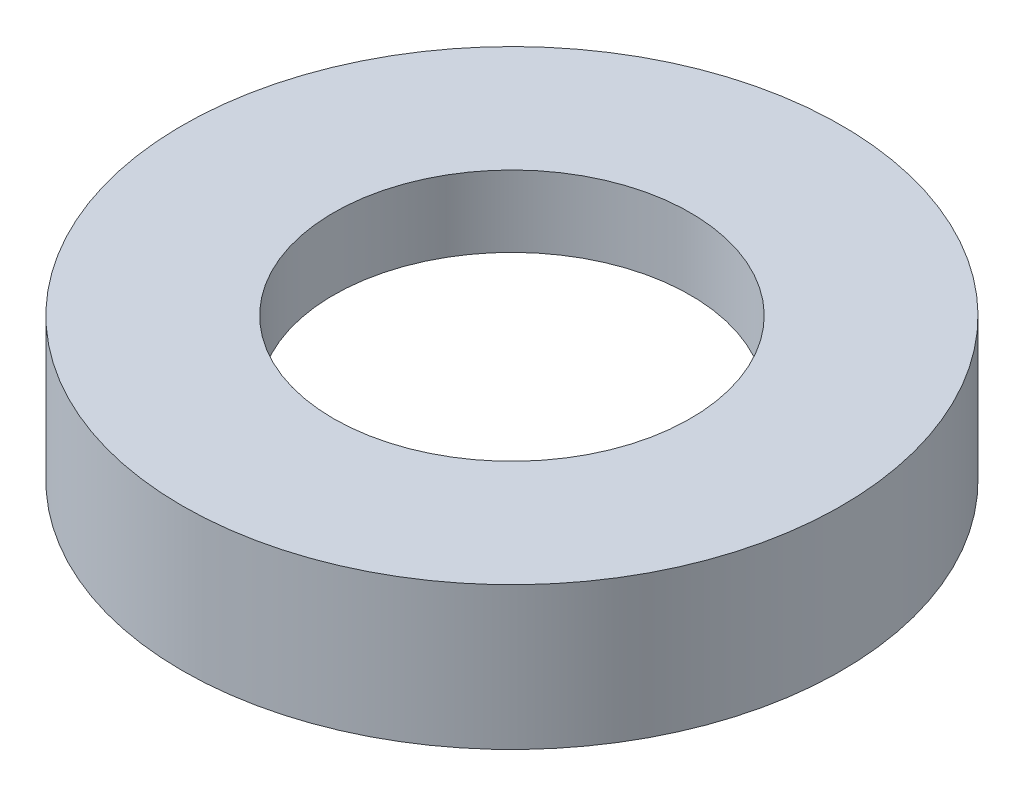
ISO-10303-21;
HEADER;
FILE_DESCRIPTION(('STEP AP214'),'2;1');
FILE_NAME('part.step','',(''),(''),'','','');
FILE_SCHEMA(('AUTOMOTIVE_DESIGN { 1 0 10303 214 1 1 1 1 }'));
ENDSEC;
DATA;
#1=APPLICATION_CONTEXT('core data for automotive mechanical design processes');
#2=APPLICATION_PROTOCOL_DEFINITION('international standard','automotive_design',2000,#1);
#3=PRODUCT_CONTEXT('',#1,'mechanical');
#4=PRODUCT('Part','Part','',(#3));
#5=PRODUCT_RELATED_PRODUCT_CATEGORY('part','',(#4));
#6=PRODUCT_DEFINITION_FORMATION('','',#4);
#7=PRODUCT_DEFINITION_CONTEXT('part definition',#1,'design');
#8=PRODUCT_DEFINITION('design','',#6,#7);
#9=PRODUCT_DEFINITION_SHAPE('','',#8);
#10=(LENGTH_UNIT() NAMED_UNIT(*) SI_UNIT(.MILLI.,.METRE.));
#11=(NAMED_UNIT(*) PLANE_ANGLE_UNIT() SI_UNIT($,.RADIAN.));
#12=(NAMED_UNIT(*) SI_UNIT($,.STERADIAN.) SOLID_ANGLE_UNIT());
#13=UNCERTAINTY_MEASURE_WITH_UNIT(LENGTH_MEASURE(1.E-05),#10,'distance_accuracy_value','');
#14=(GEOMETRIC_REPRESENTATION_CONTEXT(3) GLOBAL_UNCERTAINTY_ASSIGNED_CONTEXT((#13)) GLOBAL_UNIT_ASSIGNED_CONTEXT((#10,
#11,#12)) REPRESENTATION_CONTEXT('',''));
#15=CARTESIAN_POINT('',(0.,0.,0.));
#16=DIRECTION('',(0.,0.,1.));
#17=DIRECTION('',(1.,0.,0.));
#18=AXIS2_PLACEMENT_3D('',#15,#16,#17);
#19=CARTESIAN_POINT('',(25.4,0.,0.));
#20=DIRECTION('',(0.,1.,0.));
#21=DIRECTION('',(0.,0.,1.));
#22=AXIS2_PLACEMENT_3D('',#19,#20,#21);
#23=PLANE('',#22);
#24=CARTESIAN_POINT('',(0.,0.,0.));
#25=DIRECTION('',(0.,1.,0.));
#26=DIRECTION('',(0.,0.,1.));
#27=AXIS2_PLACEMENT_3D('',#24,#25,#26);
#28=CIRCLE('',#27,25.4);
#29=CARTESIAN_POINT('',(0.,0.,25.4));
#30=VERTEX_POINT('',#29);
#31=EDGE_CURVE('E63',#30,#30,#28,.T.);
#32=ORIENTED_EDGE('',*,*,#31,.F.);
#33=EDGE_LOOP('',(#32));
#34=FACE_BOUND('',#33,.T.);
#35=CARTESIAN_POINT('',(0.,0.,0.));
#36=DIRECTION('',(0.,1.,0.));
#37=DIRECTION('',(0.,0.,1.));
#38=AXIS2_PLACEMENT_3D('',#35,#36,#37);
#39=CIRCLE('',#38,23.5);
#40=CARTESIAN_POINT('',(0.,0.,23.5));
#41=VERTEX_POINT('',#40);
#42=EDGE_CURVE('E10',#41,#41,#39,.T.);
#43=ORIENTED_EDGE('',*,*,#42,.T.);
#44=EDGE_LOOP('',(#43));
#45=FACE_BOUND('',#44,.T.);
#46=ADVANCED_FACE('F35',(#34,#45),#23,.F.);
#47=CARTESIAN_POINT('',(0.,60.0208204142554,0.));
#48=DIRECTION('',(0.,1.,0.));
#49=DIRECTION('',(0.,0.,1.));
#50=AXIS2_PLACEMENT_3D('',#47,#48,#49);
#51=CYLINDRICAL_SURFACE('',#50,23.5);
#52=ORIENTED_EDGE('',*,*,#42,.F.);
#53=EDGE_LOOP('',(#52));
#54=FACE_BOUND('',#53,.T.);
#55=CARTESIAN_POINT('',(0.,4.5,0.));
#56=DIRECTION('',(0.,1.,0.));
#57=DIRECTION('',(0.,0.,1.));
#58=AXIS2_PLACEMENT_3D('',#55,#56,#57);
#59=CIRCLE('',#58,23.5);
#60=CARTESIAN_POINT('',(0.,4.5,23.5));
#61=VERTEX_POINT('',#60);
#62=EDGE_CURVE('E41',#61,#61,#59,.T.);
#63=ORIENTED_EDGE('',*,*,#62,.T.);
#64=EDGE_LOOP('',(#63));
#65=FACE_BOUND('',#64,.T.);
#66=ADVANCED_FACE('F70',(#54,#65),#51,.F.);
#67=CARTESIAN_POINT('',(23.5,4.5,0.));
#68=DIRECTION('',(0.,-1.,0.));
#69=DIRECTION('',(0.,0.,-1.));
#70=AXIS2_PLACEMENT_3D('',#67,#68,#69);
#71=PLANE('',#70);
#72=ORIENTED_EDGE('',*,*,#62,.F.);
#73=EDGE_LOOP('',(#72));
#74=FACE_BOUND('',#73,.T.);
#75=CARTESIAN_POINT('',(0.,4.5,0.));
#76=DIRECTION('',(0.,1.,0.));
#77=DIRECTION('',(0.,0.,1.));
#78=AXIS2_PLACEMENT_3D('',#75,#76,#77);
#79=CIRCLE('',#78,24.1);
#80=CARTESIAN_POINT('',(0.,4.5,24.1));
#81=VERTEX_POINT('',#80);
#82=EDGE_CURVE('E45',#81,#81,#79,.T.);
#83=ORIENTED_EDGE('',*,*,#82,.T.);
#84=EDGE_LOOP('',(#83));
#85=FACE_BOUND('',#84,.T.);
#86=ADVANCED_FACE('F74',(#74,#85),#71,.F.);
#87=CARTESIAN_POINT('',(0.,60.0208204142554,0.));
#88=DIRECTION('',(0.,1.,0.));
#89=DIRECTION('',(0.,0.,1.));
#90=AXIS2_PLACEMENT_3D('',#87,#88,#89);
#91=CYLINDRICAL_SURFACE('',#90,24.1);
#92=ORIENTED_EDGE('',*,*,#82,.F.);
#93=EDGE_LOOP('',(#92));
#94=FACE_BOUND('',#93,.T.);
#95=CARTESIAN_POINT('',(0.,5.5,0.));
#96=DIRECTION('',(0.,1.,0.));
#97=DIRECTION('',(0.,0.,1.));
#98=AXIS2_PLACEMENT_3D('',#95,#96,#97);
#99=CIRCLE('',#98,24.1);
#100=CARTESIAN_POINT('',(0.,5.5,24.1));
#101=VERTEX_POINT('',#100);
#102=EDGE_CURVE('E49',#101,#101,#99,.T.);
#103=ORIENTED_EDGE('',*,*,#102,.T.);
#104=EDGE_LOOP('',(#103));
#105=FACE_BOUND('',#104,.T.);
#106=ADVANCED_FACE('F79',(#94,#105),#91,.F.);
#107=CARTESIAN_POINT('',(24.1,5.5,0.));
#108=DIRECTION('',(0.,1.,0.));
#109=DIRECTION('',(0.,0.,1.));
#110=AXIS2_PLACEMENT_3D('',#107,#108,#109);
#111=PLANE('',#110);
#112=ORIENTED_EDGE('',*,*,#102,.F.);
#113=EDGE_LOOP('',(#112));
#114=FACE_BOUND('',#113,.T.);
#115=CARTESIAN_POINT('',(0.,5.5,0.));
#116=DIRECTION('',(0.,1.,0.));
#117=DIRECTION('',(0.,0.,1.));
#118=AXIS2_PLACEMENT_3D('',#115,#116,#117);
#119=CIRCLE('',#118,13.75);
#120=CARTESIAN_POINT('',(0.,5.5,13.75));
#121=VERTEX_POINT('',#120);
#122=EDGE_CURVE('E54',#121,#121,#119,.T.);
#123=ORIENTED_EDGE('',*,*,#122,.T.);
#124=EDGE_LOOP('',(#123));
#125=FACE_BOUND('',#124,.T.);
#126=ADVANCED_FACE('F85',(#114,#125),#111,.F.);
#127=CARTESIAN_POINT('',(0.,60.0208204142554,0.));
#128=DIRECTION('',(0.,1.,0.));
#129=DIRECTION('',(0.,0.,1.));
#130=AXIS2_PLACEMENT_3D('',#127,#128,#129);
#131=CYLINDRICAL_SURFACE('',#130,13.75);
#132=ORIENTED_EDGE('',*,*,#122,.F.);
#133=EDGE_LOOP('',(#132));
#134=FACE_BOUND('',#133,.T.);
#135=CARTESIAN_POINT('',(0.,11.,0.));
#136=DIRECTION('',(0.,1.,0.));
#137=DIRECTION('',(0.,0.,1.));
#138=AXIS2_PLACEMENT_3D('',#135,#136,#137);
#139=CIRCLE('',#138,13.75);
#140=CARTESIAN_POINT('',(0.,11.,13.75));
#141=VERTEX_POINT('',#140);
#142=EDGE_CURVE('E57',#141,#141,#139,.T.);
#143=ORIENTED_EDGE('',*,*,#142,.T.);
#144=EDGE_LOOP('',(#143));
#145=FACE_BOUND('',#144,.T.);
#146=ADVANCED_FACE('F89',(#134,#145),#131,.F.);
#147=CARTESIAN_POINT('',(13.75,11.,0.));
#148=DIRECTION('',(0.,-1.,0.));
#149=DIRECTION('',(0.,0.,-1.));
#150=AXIS2_PLACEMENT_3D('',#147,#148,#149);
#151=PLANE('',#150);
#152=ORIENTED_EDGE('',*,*,#142,.F.);
#153=EDGE_LOOP('',(#152));
#154=FACE_BOUND('',#153,.T.);
#155=CARTESIAN_POINT('',(0.,11.,0.));
#156=DIRECTION('',(0.,1.,0.));
#157=DIRECTION('',(0.,0.,1.));
#158=AXIS2_PLACEMENT_3D('',#155,#156,#157);
#159=CIRCLE('',#158,25.4);
#160=CARTESIAN_POINT('',(0.,11.,25.4));
#161=VERTEX_POINT('',#160);
#162=EDGE_CURVE('E60',#161,#161,#159,.T.);
#163=ORIENTED_EDGE('',*,*,#162,.T.);
#164=EDGE_LOOP('',(#163));
#165=FACE_BOUND('',#164,.T.);
#166=ADVANCED_FACE('F93',(#154,#165),#151,.F.);
#167=CARTESIAN_POINT('',(0.,60.0208204142554,0.));
#168=DIRECTION('',(0.,1.,0.));
#169=DIRECTION('',(0.,0.,1.));
#170=AXIS2_PLACEMENT_3D('',#167,#168,#169);
#171=CYLINDRICAL_SURFACE('',#170,25.4);
#172=ORIENTED_EDGE('',*,*,#162,.F.);
#173=EDGE_LOOP('',(#172));
#174=FACE_BOUND('',#173,.T.);
#175=ORIENTED_EDGE('',*,*,#31,.T.);
#176=EDGE_LOOP('',(#175));
#177=FACE_BOUND('',#176,.T.);
#178=ADVANCED_FACE('F67',(#174,#177),#171,.T.);
#179=CLOSED_SHELL('',(#46,#66,#86,#106,#126,#146,#166,#178));
#180=MANIFOLD_SOLID_BREP('B2',#179);
#181=ADVANCED_BREP_SHAPE_REPRESENTATION('',(#18,#180),#14);
#182=SHAPE_DEFINITION_REPRESENTATION(#9,#181);
ENDSEC;
END-ISO-10303-21;
